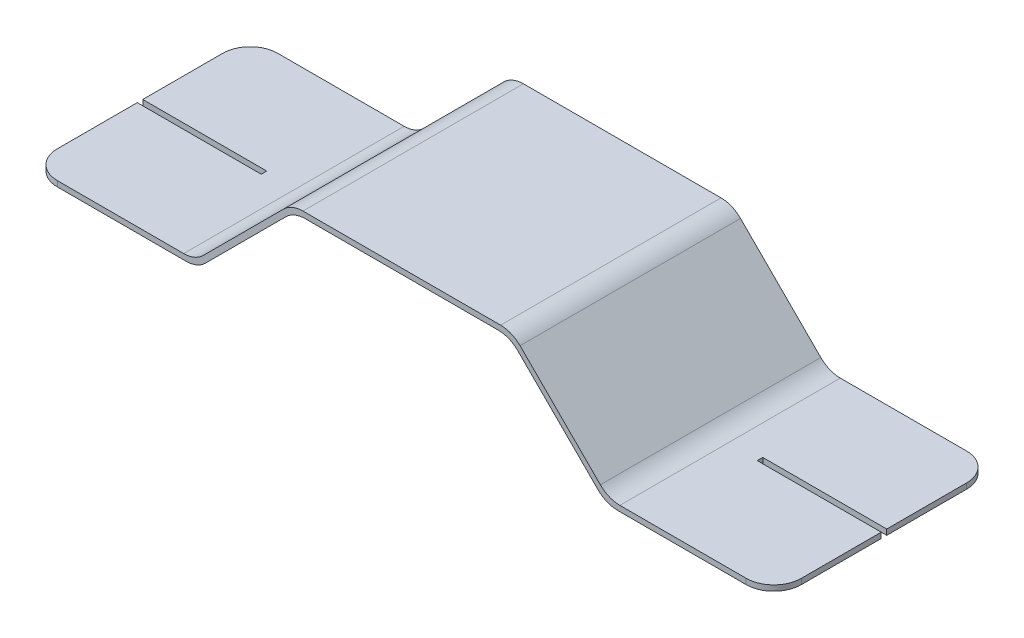
ISO-10303-21;
HEADER;
FILE_DESCRIPTION(('STEP AP214'),'2;1');
FILE_NAME('part.step','',(''),(''),'','','');
FILE_SCHEMA(('AUTOMOTIVE_DESIGN { 1 0 10303 214 1 1 1 1 }'));
ENDSEC;
DATA;
#1=APPLICATION_CONTEXT('core data for automotive mechanical design processes');
#2=APPLICATION_PROTOCOL_DEFINITION('international standard','automotive_design',2000,#1);
#3=PRODUCT_CONTEXT('',#1,'mechanical');
#4=PRODUCT('Part','Part','',(#3));
#5=PRODUCT_RELATED_PRODUCT_CATEGORY('part','',(#4));
#6=PRODUCT_DEFINITION_FORMATION('','',#4);
#7=PRODUCT_DEFINITION_CONTEXT('part definition',#1,'design');
#8=PRODUCT_DEFINITION('design','',#6,#7);
#9=PRODUCT_DEFINITION_SHAPE('','',#8);
#10=(LENGTH_UNIT() NAMED_UNIT(*) SI_UNIT(.MILLI.,.METRE.));
#11=(NAMED_UNIT(*) PLANE_ANGLE_UNIT() SI_UNIT($,.RADIAN.));
#12=(NAMED_UNIT(*) SI_UNIT($,.STERADIAN.) SOLID_ANGLE_UNIT());
#13=UNCERTAINTY_MEASURE_WITH_UNIT(LENGTH_MEASURE(1.E-05),#10,'distance_accuracy_value','');
#14=(GEOMETRIC_REPRESENTATION_CONTEXT(3) GLOBAL_UNCERTAINTY_ASSIGNED_CONTEXT((#13)) GLOBAL_UNIT_ASSIGNED_CONTEXT((#10,
#11,#12)) REPRESENTATION_CONTEXT('',''));
#15=CARTESIAN_POINT('',(0.,0.,0.));
#16=DIRECTION('',(0.,0.,1.));
#17=DIRECTION('',(1.,0.,0.));
#18=AXIS2_PLACEMENT_3D('',#15,#16,#17);
#19=CARTESIAN_POINT('',(11.4171572875254,-3.7,8.));
#20=DIRECTION('',(0.,1.,0.));
#21=DIRECTION('',(0.,0.,1.));
#22=AXIS2_PLACEMENT_3D('',#19,#20,#21);
#23=PLANE('',#22);
#24=DIRECTION('',(-1.,0.,0.));
#25=VECTOR('',#24,1.);
#26=CARTESIAN_POINT('',(11.4171572875254,-3.7,4.1));
#27=LINE('',#26,#25);
#28=CARTESIAN_POINT('',(17.5,-3.7,4.1));
#29=VERTEX_POINT('',#28);
#30=CARTESIAN_POINT('',(13.,-3.7,4.1));
#31=VERTEX_POINT('',#30);
#32=EDGE_CURVE('E292',#29,#31,#27,.T.);
#33=ORIENTED_EDGE('',*,*,#32,.F.);
#34=DIRECTION('',(0.,0.,-1.));
#35=VECTOR('',#34,1.);
#36=CARTESIAN_POINT('',(17.5,-3.7,8.));
#37=LINE('',#36,#35);
#38=CARTESIAN_POINT('',(17.5,-3.7,7.));
#39=VERTEX_POINT('',#38);
#40=EDGE_CURVE('E408',#39,#29,#37,.T.);
#41=ORIENTED_EDGE('',*,*,#40,.F.);
#42=CARTESIAN_POINT('',(16.5,-3.7,7.));
#43=DIRECTION('',(0.,1.,0.));
#44=DIRECTION('',(0.,0.,1.));
#45=AXIS2_PLACEMENT_3D('',#42,#43,#44);
#46=CIRCLE('',#45,1.);
#47=CARTESIAN_POINT('',(16.5,-3.7,8.));
#48=VERTEX_POINT('',#47);
#49=EDGE_CURVE('E555',#39,#48,#46,.F.);
#50=ORIENTED_EDGE('',*,*,#49,.T.);
#51=DIRECTION('',(1.,0.,0.));
#52=VECTOR('',#51,1.);
#53=CARTESIAN_POINT('',(11.4171572875254,-3.7,8.));
#54=LINE('',#53,#52);
#55=CARTESIAN_POINT('',(11.8313708498985,-3.7,8.));
#56=VERTEX_POINT('',#55);
#57=EDGE_CURVE('E350',#56,#48,#54,.T.);
#58=ORIENTED_EDGE('',*,*,#57,.F.);
#59=DIRECTION('',(0.,0.,-1.));
#60=VECTOR('',#59,1.);
#61=CARTESIAN_POINT('',(11.8313708498985,-3.7,8.));
#62=LINE('',#61,#60);
#63=CARTESIAN_POINT('',(11.8313708498985,-3.7,0.));
#64=VERTEX_POINT('',#63);
#65=EDGE_CURVE('E442',#56,#64,#62,.T.);
#66=ORIENTED_EDGE('',*,*,#65,.T.);
#67=DIRECTION('',(1.,0.,0.));
#68=VECTOR('',#67,1.);
#69=CARTESIAN_POINT('',(11.4171572875254,-3.7,0.));
#70=LINE('',#69,#68);
#71=CARTESIAN_POINT('',(16.5,-3.7,0.));
#72=VERTEX_POINT('',#71);
#73=EDGE_CURVE('E390',#64,#72,#70,.T.);
#74=ORIENTED_EDGE('',*,*,#73,.T.);
#75=CARTESIAN_POINT('',(16.5,-3.7,1.));
#76=DIRECTION('',(0.,1.,0.));
#77=DIRECTION('',(0.,0.,1.));
#78=AXIS2_PLACEMENT_3D('',#75,#76,#77);
#79=CIRCLE('',#78,1.);
#80=CARTESIAN_POINT('',(17.5,-3.7,1.));
#81=VERTEX_POINT('',#80);
#82=EDGE_CURVE('E558',#72,#81,#79,.F.);
#83=ORIENTED_EDGE('',*,*,#82,.T.);
#84=CARTESIAN_POINT('',(17.5,-3.7,3.9));
#85=VERTEX_POINT('',#84);
#86=EDGE_CURVE('E407',#85,#81,#37,.T.);
#87=ORIENTED_EDGE('',*,*,#86,.F.);
#88=DIRECTION('',(1.,0.,0.));
#89=VECTOR('',#88,1.);
#90=CARTESIAN_POINT('',(11.4171572875254,-3.7,3.9));
#91=LINE('',#90,#89);
#92=CARTESIAN_POINT('',(13.,-3.7,3.9));
#93=VERTEX_POINT('',#92);
#94=EDGE_CURVE('E283',#93,#85,#91,.T.);
#95=ORIENTED_EDGE('',*,*,#94,.F.);
#96=DIRECTION('',(0.,0.,-1.));
#97=VECTOR('',#96,1.);
#98=CARTESIAN_POINT('',(13.,-3.7,8.));
#99=LINE('',#98,#97);
#100=EDGE_CURVE('E260',#31,#93,#99,.T.);
#101=ORIENTED_EDGE('',*,*,#100,.F.);
#102=EDGE_LOOP('',(#33,#41,#50,#58,#66,#74,#83,#87,#95,#101));
#103=FACE_BOUND('',#102,.T.);
#104=ADVANCED_FACE('F42',(#103),#23,.F.);
#105=CARTESIAN_POINT('',(17.5,-3.5,8.));
#106=DIRECTION('',(-1.,0.,0.));
#107=DIRECTION('',(0.,0.,1.));
#108=AXIS2_PLACEMENT_3D('',#105,#106,#107);
#109=PLANE('',#108);
#110=DIRECTION('',(0.,1.,0.));
#111=VECTOR('',#110,1.);
#112=CARTESIAN_POINT('',(17.5,-13.5,4.1));
#113=LINE('',#112,#111);
#114=CARTESIAN_POINT('',(17.5,-3.5,4.1));
#115=VERTEX_POINT('',#114);
#116=EDGE_CURVE('E279',#29,#115,#113,.T.);
#117=ORIENTED_EDGE('',*,*,#116,.T.);
#118=DIRECTION('',(0.,0.,-1.));
#119=VECTOR('',#118,1.);
#120=CARTESIAN_POINT('',(17.5,-3.5,8.));
#121=LINE('',#120,#119);
#122=CARTESIAN_POINT('',(17.5,-3.5,7.));
#123=VERTEX_POINT('',#122);
#124=EDGE_CURVE('E404',#123,#115,#121,.T.);
#125=ORIENTED_EDGE('',*,*,#124,.F.);
#126=DIRECTION('',(0.,1.,0.));
#127=VECTOR('',#126,1.);
#128=CARTESIAN_POINT('',(17.5,-3.7,7.));
#129=LINE('',#128,#127);
#130=EDGE_CURVE('E536',#123,#39,#129,.F.);
#131=ORIENTED_EDGE('',*,*,#130,.T.);
#132=ORIENTED_EDGE('',*,*,#40,.T.);
#133=EDGE_LOOP('',(#117,#125,#131,#132));
#134=FACE_BOUND('',#133,.T.);
#135=ADVANCED_FACE('F718',(#134),#109,.F.);
#136=DIRECTION('',(0.,1.,0.));
#137=VECTOR('',#136,1.);
#138=CARTESIAN_POINT('',(17.5,-13.5,3.9));
#139=LINE('',#138,#137);
#140=CARTESIAN_POINT('',(17.5,-3.5,3.9));
#141=VERTEX_POINT('',#140);
#142=EDGE_CURVE('E58',#85,#141,#139,.T.);
#143=ORIENTED_EDGE('',*,*,#142,.F.);
#144=ORIENTED_EDGE('',*,*,#86,.T.);
#145=DIRECTION('',(0.,1.,0.));
#146=VECTOR('',#145,1.);
#147=CARTESIAN_POINT('',(17.5,-3.5,1.));
#148=LINE('',#147,#146);
#149=CARTESIAN_POINT('',(17.5,-3.5,1.));
#150=VERTEX_POINT('',#149);
#151=EDGE_CURVE('E539',#81,#150,#148,.T.);
#152=ORIENTED_EDGE('',*,*,#151,.T.);
#153=EDGE_CURVE('E365',#141,#150,#121,.T.);
#154=ORIENTED_EDGE('',*,*,#153,.F.);
#155=EDGE_LOOP('',(#143,#144,#152,#154));
#156=FACE_BOUND('',#155,.T.);
#157=ADVANCED_FACE('F624',(#156),#109,.F.);
#158=CARTESIAN_POINT('',(11.5,-3.5,8.));
#159=DIRECTION('',(0.,-1.,0.));
#160=DIRECTION('',(1.,0.,0.));
#161=AXIS2_PLACEMENT_3D('',#158,#159,#160);
#162=PLANE('',#161);
#163=DIRECTION('',(-1.,0.,0.));
#164=VECTOR('',#163,1.);
#165=CARTESIAN_POINT('',(17.5,-3.5,4.1));
#166=LINE('',#165,#164);
#167=CARTESIAN_POINT('',(13.,-3.5,4.1));
#168=VERTEX_POINT('',#167);
#169=EDGE_CURVE('E273',#115,#168,#166,.T.);
#170=ORIENTED_EDGE('',*,*,#169,.T.);
#171=DIRECTION('',(0.,0.,-1.));
#172=VECTOR('',#171,1.);
#173=CARTESIAN_POINT('',(13.,-3.5,3.9));
#174=LINE('',#173,#172);
#175=CARTESIAN_POINT('',(13.,-3.5,3.9));
#176=VERTEX_POINT('',#175);
#177=EDGE_CURVE('E257',#168,#176,#174,.T.);
#178=ORIENTED_EDGE('',*,*,#177,.T.);
#179=DIRECTION('',(1.,0.,0.));
#180=VECTOR('',#179,1.);
#181=CARTESIAN_POINT('',(17.5,-3.5,3.9));
#182=LINE('',#181,#180);
#183=EDGE_CURVE('E265',#176,#141,#182,.T.);
#184=ORIENTED_EDGE('',*,*,#183,.T.);
#185=ORIENTED_EDGE('',*,*,#153,.T.);
#186=CARTESIAN_POINT('',(16.5,-3.5,1.));
#187=DIRECTION('',(0.,-1.,0.));
#188=DIRECTION('',(1.,0.,0.));
#189=AXIS2_PLACEMENT_3D('',#186,#187,#188);
#190=CIRCLE('',#189,1.);
#191=CARTESIAN_POINT('',(16.5,-3.5,0.));
#192=VERTEX_POINT('',#191);
#193=EDGE_CURVE('E546',#150,#192,#190,.F.);
#194=ORIENTED_EDGE('',*,*,#193,.T.);
#195=DIRECTION('',(-1.,0.,0.));
#196=VECTOR('',#195,1.);
#197=CARTESIAN_POINT('',(11.5,-3.5,0.));
#198=LINE('',#197,#196);
#199=CARTESIAN_POINT('',(11.9142135623731,-3.5,0.));
#200=VERTEX_POINT('',#199);
#201=EDGE_CURVE('E394',#192,#200,#198,.T.);
#202=ORIENTED_EDGE('',*,*,#201,.T.);
#203=DIRECTION('',(0.,0.,-1.));
#204=VECTOR('',#203,1.);
#205=CARTESIAN_POINT('',(11.9142135623731,-3.5,8.));
#206=LINE('',#205,#204);
#207=CARTESIAN_POINT('',(11.9142135623731,-3.5,8.));
#208=VERTEX_POINT('',#207);
#209=EDGE_CURVE('E489',#200,#208,#206,.F.);
#210=ORIENTED_EDGE('',*,*,#209,.T.);
#211=DIRECTION('',(-1.,0.,0.));
#212=VECTOR('',#211,1.);
#213=CARTESIAN_POINT('',(11.5,-3.5,8.));
#214=LINE('',#213,#212);
#215=CARTESIAN_POINT('',(16.5,-3.5,8.));
#216=VERTEX_POINT('',#215);
#217=EDGE_CURVE('E354',#216,#208,#214,.T.);
#218=ORIENTED_EDGE('',*,*,#217,.F.);
#219=CARTESIAN_POINT('',(16.5,-3.5,7.));
#220=DIRECTION('',(0.,-1.,0.));
#221=DIRECTION('',(1.,0.,0.));
#222=AXIS2_PLACEMENT_3D('',#219,#220,#221);
#223=CIRCLE('',#222,1.);
#224=EDGE_CURVE('E543',#216,#123,#223,.F.);
#225=ORIENTED_EDGE('',*,*,#224,.T.);
#226=ORIENTED_EDGE('',*,*,#124,.T.);
#227=EDGE_LOOP('',(#170,#178,#184,#185,#194,#202,#210,#218,#225,#226));
#228=FACE_BOUND('',#227,.T.);
#229=ADVANCED_FACE('F271',(#228),#162,.F.);
#230=CARTESIAN_POINT('',(-9.5,-3.5,8.));
#231=DIRECTION('',(1.,0.,0.));
#232=DIRECTION('',(0.,0.,-1.));
#233=AXIS2_PLACEMENT_3D('',#230,#231,#232);
#234=PLANE('',#233);
#235=DIRECTION('',(0.,0.,-1.));
#236=VECTOR('',#235,1.);
#237=CARTESIAN_POINT('',(-9.5,-3.7,8.));
#238=LINE('',#237,#236);
#239=CARTESIAN_POINT('',(-9.5,-3.7,3.9));
#240=VERTEX_POINT('',#239);
#241=CARTESIAN_POINT('',(-9.5,-3.7,1.));
#242=VERTEX_POINT('',#241);
#243=EDGE_CURVE('E412',#240,#242,#238,.T.);
#244=ORIENTED_EDGE('',*,*,#243,.F.);
#245=DIRECTION('',(0.,1.,0.));
#246=VECTOR('',#245,1.);
#247=CARTESIAN_POINT('',(-9.5,-13.5,3.9));
#248=LINE('',#247,#246);
#249=CARTESIAN_POINT('',(-9.5,-3.5,3.9));
#250=VERTEX_POINT('',#249);
#251=EDGE_CURVE('E306',#240,#250,#248,.T.);
#252=ORIENTED_EDGE('',*,*,#251,.T.);
#253=DIRECTION('',(0.,0.,-1.));
#254=VECTOR('',#253,1.);
#255=CARTESIAN_POINT('',(-9.5,-3.5,8.));
#256=LINE('',#255,#254);
#257=CARTESIAN_POINT('',(-9.5,-3.5,1.));
#258=VERTEX_POINT('',#257);
#259=EDGE_CURVE('E417',#250,#258,#256,.T.);
#260=ORIENTED_EDGE('',*,*,#259,.T.);
#261=DIRECTION('',(0.,-1.,0.));
#262=VECTOR('',#261,1.);
#263=CARTESIAN_POINT('',(-9.5,-3.5,1.));
#264=LINE('',#263,#262);
#265=EDGE_CURVE('E573',#258,#242,#264,.T.);
#266=ORIENTED_EDGE('',*,*,#265,.T.);
#267=EDGE_LOOP('',(#244,#252,#260,#266));
#268=FACE_BOUND('',#267,.T.);
#269=ADVANCED_FACE('F607',(#268),#234,.F.);
#270=CARTESIAN_POINT('',(0.,0.,8.));
#271=DIRECTION('',(0.707106781186548,-0.707106781186547,0.));
#272=DIRECTION('',(0.707106781186547,0.707106781186548,0.));
#273=AXIS2_PLACEMENT_3D('',#270,#271,#272);
#274=PLANE('',#273);
#275=CARTESIAN_POINT('',(-1.76776695296637,-1.76776695296637,2.25));
#276=DIRECTION('',(-0.707106781186548,0.707106781186547,0.));
#277=DIRECTION('',(-0.707106781186547,-0.707106781186548,0.));
#278=AXIS2_PLACEMENT_3D('',#275,#276,#277);
#279=CIRCLE('',#278,1.190625);
#280=CARTESIAN_POINT('',(-2.6096659643166,-2.6096659643166,2.25));
#281=VERTEX_POINT('',#280);
#282=EDGE_CURVE('E318',#281,#281,#279,.T.);
#283=ORIENTED_EDGE('',*,*,#282,.F.);
#284=EDGE_LOOP('',(#283));
#285=FACE_BOUND('',#284,.T.);
#286=CARTESIAN_POINT('',(-1.76776695296637,-1.76776695296637,5.75));
#287=DIRECTION('',(-0.707106781186548,0.707106781186547,0.));
#288=DIRECTION('',(-0.707106781186547,-0.707106781186548,0.));
#289=AXIS2_PLACEMENT_3D('',#286,#287,#288);
#290=CIRCLE('',#289,1.190625);
#291=CARTESIAN_POINT('',(-2.6096659643166,-2.6096659643166,5.75));
#292=VERTEX_POINT('',#291);
#293=EDGE_CURVE('E310',#292,#292,#290,.T.);
#294=ORIENTED_EDGE('',*,*,#293,.F.);
#295=EDGE_LOOP('',(#294));
#296=FACE_BOUND('',#295,.T.);
#297=DIRECTION('',(-0.707106781186547,-0.707106781186548,0.));
#298=VECTOR('',#297,1.);
#299=CARTESIAN_POINT('',(0.,0.,8.));
#300=LINE('',#299,#298);
#301=CARTESIAN_POINT('',(-0.292893218813452,-0.292893218813452,8.));
#302=VERTEX_POINT('',#301);
#303=CARTESIAN_POINT('',(-3.20710678118655,-3.20710678118655,8.));
#304=VERTEX_POINT('',#303);
#305=EDGE_CURVE('E326',#302,#304,#300,.T.);
#306=ORIENTED_EDGE('',*,*,#305,.F.);
#307=DIRECTION('',(0.,0.,-1.));
#308=VECTOR('',#307,1.);
#309=CARTESIAN_POINT('',(-0.292893218813452,-0.292893218813452,8.));
#310=LINE('',#309,#308);
#311=CARTESIAN_POINT('',(-0.292893218813452,-0.292893218813452,0.));
#312=VERTEX_POINT('',#311);
#313=EDGE_CURVE('E503',#302,#312,#310,.T.);
#314=ORIENTED_EDGE('',*,*,#313,.T.);
#315=DIRECTION('',(-0.707106781186547,-0.707106781186548,0.));
#316=VECTOR('',#315,1.);
#317=CARTESIAN_POINT('',(0.,0.,0.));
#318=LINE('',#317,#316);
#319=CARTESIAN_POINT('',(-3.20710678118655,-3.20710678118655,0.));
#320=VERTEX_POINT('',#319);
#321=EDGE_CURVE('E366',#312,#320,#318,.T.);
#322=ORIENTED_EDGE('',*,*,#321,.T.);
#323=DIRECTION('',(0.,0.,-1.));
#324=VECTOR('',#323,1.);
#325=CARTESIAN_POINT('',(-3.20710678118655,-3.20710678118655,8.));
#326=LINE('',#325,#324);
#327=EDGE_CURVE('E500',#320,#304,#326,.F.);
#328=ORIENTED_EDGE('',*,*,#327,.T.);
#329=EDGE_LOOP('',(#306,#314,#322,#328));
#330=FACE_BOUND('',#329,.T.);
#331=ADVANCED_FACE('F663',(#285,#296,#330),#274,.F.);
#332=CARTESIAN_POINT('',(-3.5,-3.5,8.));
#333=DIRECTION('',(0.,-1.,0.));
#334=DIRECTION('',(1.,0.,0.));
#335=AXIS2_PLACEMENT_3D('',#332,#333,#334);
#336=PLANE('',#335);
#337=ORIENTED_EDGE('',*,*,#259,.F.);
#338=DIRECTION('',(-1.,0.,0.));
#339=VECTOR('',#338,1.);
#340=CARTESIAN_POINT('',(-9.5,-3.5,3.9));
#341=LINE('',#340,#339);
#342=CARTESIAN_POINT('',(-5.,-3.5,3.9));
#343=VERTEX_POINT('',#342);
#344=EDGE_CURVE('E302',#343,#250,#341,.T.);
#345=ORIENTED_EDGE('',*,*,#344,.F.);
#346=DIRECTION('',(0.,0.,-1.));
#347=VECTOR('',#346,1.);
#348=CARTESIAN_POINT('',(-5.,-3.5,3.9));
#349=LINE('',#348,#347);
#350=CARTESIAN_POINT('',(-5.,-3.5,4.1));
#351=VERTEX_POINT('',#350);
#352=EDGE_CURVE('E298',#351,#343,#349,.T.);
#353=ORIENTED_EDGE('',*,*,#352,.F.);
#354=DIRECTION('',(1.,0.,0.));
#355=VECTOR('',#354,1.);
#356=CARTESIAN_POINT('',(-9.5,-3.5,4.1));
#357=LINE('',#356,#355);
#358=CARTESIAN_POINT('',(-9.5,-3.5,4.1));
#359=VERTEX_POINT('',#358);
#360=EDGE_CURVE('E295',#359,#351,#357,.T.);
#361=ORIENTED_EDGE('',*,*,#360,.F.);
#362=CARTESIAN_POINT('',(-9.5,-3.5,7.));
#363=VERTEX_POINT('',#362);
#364=EDGE_CURVE('E418',#363,#359,#256,.T.);
#365=ORIENTED_EDGE('',*,*,#364,.F.);
#366=CARTESIAN_POINT('',(-8.5,-3.5,7.));
#367=DIRECTION('',(0.,-1.,0.));
#368=DIRECTION('',(1.,0.,0.));
#369=AXIS2_PLACEMENT_3D('',#366,#367,#368);
#370=CIRCLE('',#369,1.);
#371=CARTESIAN_POINT('',(-8.5,-3.5,8.));
#372=VERTEX_POINT('',#371);
#373=EDGE_CURVE('E583',#363,#372,#370,.F.);
#374=ORIENTED_EDGE('',*,*,#373,.T.);
#375=DIRECTION('',(-1.,0.,0.));
#376=VECTOR('',#375,1.);
#377=CARTESIAN_POINT('',(-3.5,-3.5,8.));
#378=LINE('',#377,#376);
#379=CARTESIAN_POINT('',(-3.91421356237309,-3.5,8.));
#380=VERTEX_POINT('',#379);
#381=EDGE_CURVE('E330',#380,#372,#378,.T.);
#382=ORIENTED_EDGE('',*,*,#381,.F.);
#383=DIRECTION('',(0.,0.,-1.));
#384=VECTOR('',#383,1.);
#385=CARTESIAN_POINT('',(-3.91421356237309,-3.5,0.));
#386=LINE('',#385,#384);
#387=CARTESIAN_POINT('',(-3.91421356237309,-3.5,0.));
#388=VERTEX_POINT('',#387);
#389=EDGE_CURVE('E507',#380,#388,#386,.T.);
#390=ORIENTED_EDGE('',*,*,#389,.T.);
#391=DIRECTION('',(-1.,0.,0.));
#392=VECTOR('',#391,1.);
#393=CARTESIAN_POINT('',(-3.5,-3.5,0.));
#394=LINE('',#393,#392);
#395=CARTESIAN_POINT('',(-8.5,-3.5,0.));
#396=VERTEX_POINT('',#395);
#397=EDGE_CURVE('E370',#388,#396,#394,.T.);
#398=ORIENTED_EDGE('',*,*,#397,.T.);
#399=CARTESIAN_POINT('',(-8.5,-3.5,1.));
#400=DIRECTION('',(0.,-1.,0.));
#401=DIRECTION('',(1.,0.,0.));
#402=AXIS2_PLACEMENT_3D('',#399,#400,#401);
#403=CIRCLE('',#402,1.);
#404=EDGE_CURVE('E586',#396,#258,#403,.F.);
#405=ORIENTED_EDGE('',*,*,#404,.T.);
#406=EDGE_LOOP('',(#337,#345,#353,#361,#365,#374,#382,#390,#398,#405));
#407=FACE_BOUND('',#406,.T.);
#408=ADVANCED_FACE('F609',(#407),#336,.F.);
#409=ORIENTED_EDGE('',*,*,#364,.T.);
#410=DIRECTION('',(0.,1.,0.));
#411=VECTOR('',#410,1.);
#412=CARTESIAN_POINT('',(-9.5,-13.5,4.1));
#413=LINE('',#412,#411);
#414=CARTESIAN_POINT('',(-9.5,-3.7,4.1));
#415=VERTEX_POINT('',#414);
#416=EDGE_CURVE('E305',#415,#359,#413,.T.);
#417=ORIENTED_EDGE('',*,*,#416,.F.);
#418=CARTESIAN_POINT('',(-9.5,-3.7,7.));
#419=VERTEX_POINT('',#418);
#420=EDGE_CURVE('E413',#419,#415,#238,.T.);
#421=ORIENTED_EDGE('',*,*,#420,.F.);
#422=DIRECTION('',(0.,-1.,0.));
#423=VECTOR('',#422,1.);
#424=CARTESIAN_POINT('',(-9.5,-3.5,7.));
#425=LINE('',#424,#423);
#426=EDGE_CURVE('E570',#419,#363,#425,.F.);
#427=ORIENTED_EDGE('',*,*,#426,.T.);
#428=EDGE_LOOP('',(#409,#417,#421,#427));
#429=FACE_BOUND('',#428,.T.);
#430=ADVANCED_FACE('F747',(#429),#234,.F.);
#431=CARTESIAN_POINT('',(-3.41715728752538,-3.7,8.));
#432=DIRECTION('',(0.,1.,0.));
#433=DIRECTION('',(-1.,0.,0.));
#434=AXIS2_PLACEMENT_3D('',#431,#432,#433);
#435=PLANE('',#434);
#436=DIRECTION('',(0.,0.,-1.));
#437=VECTOR('',#436,1.);
#438=CARTESIAN_POINT('',(-5.,-3.7,8.));
#439=LINE('',#438,#437);
#440=CARTESIAN_POINT('',(-5.,-3.7,4.1));
#441=VERTEX_POINT('',#440);
#442=CARTESIAN_POINT('',(-5.,-3.7,3.9));
#443=VERTEX_POINT('',#442);
#444=EDGE_CURVE('E51',#441,#443,#439,.T.);
#445=ORIENTED_EDGE('',*,*,#444,.T.);
#446=DIRECTION('',(-1.,0.,0.));
#447=VECTOR('',#446,1.);
#448=CARTESIAN_POINT('',(-3.41715728752538,-3.7,3.9));
#449=LINE('',#448,#447);
#450=EDGE_CURVE('E11',#443,#240,#449,.T.);
#451=ORIENTED_EDGE('',*,*,#450,.T.);
#452=ORIENTED_EDGE('',*,*,#243,.T.);
#453=CARTESIAN_POINT('',(-8.5,-3.7,1.));
#454=DIRECTION('',(0.,1.,0.));
#455=DIRECTION('',(-1.,0.,0.));
#456=AXIS2_PLACEMENT_3D('',#453,#454,#455);
#457=CIRCLE('',#456,1.);
#458=CARTESIAN_POINT('',(-8.5,-3.7,0.));
#459=VERTEX_POINT('',#458);
#460=EDGE_CURVE('E580',#242,#459,#457,.F.);
#461=ORIENTED_EDGE('',*,*,#460,.T.);
#462=DIRECTION('',(1.,0.,0.));
#463=VECTOR('',#462,1.);
#464=CARTESIAN_POINT('',(-3.41715728752538,-3.7,0.));
#465=LINE('',#464,#463);
#466=CARTESIAN_POINT('',(-3.83137084989848,-3.7,0.));
#467=VERTEX_POINT('',#466);
#468=EDGE_CURVE('E375',#459,#467,#465,.T.);
#469=ORIENTED_EDGE('',*,*,#468,.T.);
#470=DIRECTION('',(0.,0.,-1.));
#471=VECTOR('',#470,1.);
#472=CARTESIAN_POINT('',(-3.83137084989848,-3.7,8.));
#473=LINE('',#472,#471);
#474=CARTESIAN_POINT('',(-3.83137084989848,-3.7,8.));
#475=VERTEX_POINT('',#474);
#476=EDGE_CURVE('E478',#467,#475,#473,.F.);
#477=ORIENTED_EDGE('',*,*,#476,.T.);
#478=DIRECTION('',(1.,0.,0.));
#479=VECTOR('',#478,1.);
#480=CARTESIAN_POINT('',(-3.41715728752538,-3.7,8.));
#481=LINE('',#480,#479);
#482=CARTESIAN_POINT('',(-8.5,-3.7,8.));
#483=VERTEX_POINT('',#482);
#484=EDGE_CURVE('E335',#483,#475,#481,.T.);
#485=ORIENTED_EDGE('',*,*,#484,.F.);
#486=CARTESIAN_POINT('',(-8.5,-3.7,7.));
#487=DIRECTION('',(0.,1.,0.));
#488=DIRECTION('',(-1.,0.,0.));
#489=AXIS2_PLACEMENT_3D('',#486,#487,#488);
#490=CIRCLE('',#489,1.);
#491=EDGE_CURVE('E577',#483,#419,#490,.F.);
#492=ORIENTED_EDGE('',*,*,#491,.T.);
#493=ORIENTED_EDGE('',*,*,#420,.T.);
#494=DIRECTION('',(1.,0.,0.));
#495=VECTOR('',#494,1.);
#496=CARTESIAN_POINT('',(-3.41715728752538,-3.7,4.1));
#497=LINE('',#496,#495);
#498=EDGE_CURVE('E590',#415,#441,#497,.T.);
#499=ORIENTED_EDGE('',*,*,#498,.T.);
#500=EDGE_LOOP('',(#445,#451,#452,#461,#469,#477,#485,#492,#493,#499));
#501=FACE_BOUND('',#500,.T.);
#502=ADVANCED_FACE('F596',(#501),#435,.F.);
#503=CARTESIAN_POINT('',(0.082842712474619,-0.2,8.));
#504=DIRECTION('',(-0.707106781186548,0.707106781186547,0.));
#505=DIRECTION('',(-0.707106781186547,-0.707106781186548,0.));
#506=AXIS2_PLACEMENT_3D('',#503,#504,#505);
#507=PLANE('',#506);
#508=CARTESIAN_POINT('',(-1.62634559672906,-1.90918830920368,2.25));
#509=DIRECTION('',(-0.707106781186548,0.707106781186547,0.));
#510=DIRECTION('',(-0.707106781186547,-0.707106781186548,0.));
#511=AXIS2_PLACEMENT_3D('',#508,#509,#510);
#512=CIRCLE('',#511,1.190625);
#513=CARTESIAN_POINT('',(-2.46824460807929,-2.75108732055391,2.25));
#514=VERTEX_POINT('',#513);
#515=EDGE_CURVE('E371',#514,#514,#512,.T.);
#516=ORIENTED_EDGE('',*,*,#515,.T.);
#517=EDGE_LOOP('',(#516));
#518=FACE_BOUND('',#517,.T.);
#519=CARTESIAN_POINT('',(-1.62634559672906,-1.90918830920368,5.75));
#520=DIRECTION('',(-0.707106781186548,0.707106781186547,0.));
#521=DIRECTION('',(-0.707106781186547,-0.707106781186548,0.));
#522=AXIS2_PLACEMENT_3D('',#519,#520,#521);
#523=CIRCLE('',#522,1.190625);
#524=CARTESIAN_POINT('',(-2.46824460807929,-2.75108732055391,5.75));
#525=VERTEX_POINT('',#524);
#526=EDGE_CURVE('E322',#525,#525,#523,.T.);
#527=ORIENTED_EDGE('',*,*,#526,.T.);
#528=EDGE_LOOP('',(#527));
#529=FACE_BOUND('',#528,.T.);
#530=DIRECTION('',(0.707106781186547,0.707106781186548,0.));
#531=VECTOR('',#530,1.);
#532=CARTESIAN_POINT('',(0.082842712474619,-0.2,8.));
#533=LINE('',#532,#531);
#534=CARTESIAN_POINT('',(-3.12426406871193,-3.40710678118655,8.));
#535=VERTEX_POINT('',#534);
#536=CARTESIAN_POINT('',(-0.210050506338834,-0.492893218813453,8.));
#537=VERTEX_POINT('',#536);
#538=EDGE_CURVE('E338',#535,#537,#533,.T.);
#539=ORIENTED_EDGE('',*,*,#538,.F.);
#540=DIRECTION('',(0.,0.,-1.));
#541=VECTOR('',#540,1.);
#542=CARTESIAN_POINT('',(-3.12426406871193,-3.40710678118655,8.));
#543=LINE('',#542,#541);
#544=CARTESIAN_POINT('',(-3.12426406871193,-3.40710678118655,0.));
#545=VERTEX_POINT('',#544);
#546=EDGE_CURVE('E474',#535,#545,#543,.T.);
#547=ORIENTED_EDGE('',*,*,#546,.T.);
#548=DIRECTION('',(0.707106781186547,0.707106781186548,0.));
#549=VECTOR('',#548,1.);
#550=CARTESIAN_POINT('',(0.082842712474619,-0.2,0.));
#551=LINE('',#550,#549);
#552=CARTESIAN_POINT('',(-0.210050506338834,-0.492893218813453,0.));
#553=VERTEX_POINT('',#552);
#554=EDGE_CURVE('E378',#545,#553,#551,.T.);
#555=ORIENTED_EDGE('',*,*,#554,.T.);
#556=DIRECTION('',(0.,0.,-1.));
#557=VECTOR('',#556,1.);
#558=CARTESIAN_POINT('',(-0.210050506338834,-0.492893218813453,8.));
#559=LINE('',#558,#557);
#560=EDGE_CURVE('E471',#553,#537,#559,.F.);
#561=ORIENTED_EDGE('',*,*,#560,.T.);
#562=EDGE_LOOP('',(#539,#547,#555,#561));
#563=FACE_BOUND('',#562,.T.);
#564=ADVANCED_FACE('F688',(#518,#529,#563),#507,.F.);
#565=CARTESIAN_POINT('',(0.082842712474619,-0.2,8.));
#566=DIRECTION('',(0.,1.,0.));
#567=DIRECTION('',(0.,0.,1.));
#568=AXIS2_PLACEMENT_3D('',#565,#566,#567);
#569=PLANE('',#568);
#570=DIRECTION('',(1.,0.,0.));
#571=VECTOR('',#570,1.);
#572=CARTESIAN_POINT('',(0.082842712474619,-0.2,0.));
#573=LINE('',#572,#571);
#574=CARTESIAN_POINT('',(0.497056274847714,-0.2,0.));
#575=VERTEX_POINT('',#574);
#576=CARTESIAN_POINT('',(7.50294372515229,-0.2,0.));
#577=VERTEX_POINT('',#576);
#578=EDGE_CURVE('E382',#575,#577,#573,.T.);
#579=ORIENTED_EDGE('',*,*,#578,.T.);
#580=DIRECTION('',(0.,0.,-1.));
#581=VECTOR('',#580,1.);
#582=CARTESIAN_POINT('',(7.50294372515229,-0.2,8.));
#583=LINE('',#582,#581);
#584=CARTESIAN_POINT('',(7.50294372515229,-0.2,8.));
#585=VERTEX_POINT('',#584);
#586=EDGE_CURVE('E439',#577,#585,#583,.F.);
#587=ORIENTED_EDGE('',*,*,#586,.T.);
#588=DIRECTION('',(1.,0.,0.));
#589=VECTOR('',#588,1.);
#590=CARTESIAN_POINT('',(0.082842712474619,-0.2,8.));
#591=LINE('',#590,#589);
#592=CARTESIAN_POINT('',(0.497056274847714,-0.2,8.));
#593=VERTEX_POINT('',#592);
#594=EDGE_CURVE('E342',#593,#585,#591,.T.);
#595=ORIENTED_EDGE('',*,*,#594,.F.);
#596=DIRECTION('',(0.,0.,-1.));
#597=VECTOR('',#596,1.);
#598=CARTESIAN_POINT('',(0.497056274847714,-0.2,0.));
#599=LINE('',#598,#597);
#600=EDGE_CURVE('E435',#593,#575,#599,.T.);
#601=ORIENTED_EDGE('',*,*,#600,.T.);
#602=EDGE_LOOP('',(#579,#587,#595,#601));
#603=FACE_BOUND('',#602,.T.);
#604=ADVANCED_FACE('F697',(#603),#569,.F.);
#605=CARTESIAN_POINT('',(7.91715728752538,-0.2,8.));
#606=DIRECTION('',(0.707106781186548,0.707106781186547,0.));
#607=DIRECTION('',(-0.707106781186547,0.707106781186548,0.));
#608=AXIS2_PLACEMENT_3D('',#605,#606,#607);
#609=PLANE('',#608);
#610=DIRECTION('',(0.707106781186547,-0.707106781186548,0.));
#611=VECTOR('',#610,1.);
#612=CARTESIAN_POINT('',(7.91715728752538,-0.2,8.));
#613=LINE('',#612,#611);
#614=CARTESIAN_POINT('',(8.21005050633883,-0.492893218813452,8.));
#615=VERTEX_POINT('',#614);
#616=CARTESIAN_POINT('',(11.1242640687119,-3.40710678118655,8.));
#617=VERTEX_POINT('',#616);
#618=EDGE_CURVE('E346',#615,#617,#613,.T.);
#619=ORIENTED_EDGE('',*,*,#618,.F.);
#620=DIRECTION('',(0.,0.,-1.));
#621=VECTOR('',#620,1.);
#622=CARTESIAN_POINT('',(8.21005050633883,-0.492893218813452,0.));
#623=LINE('',#622,#621);
#624=CARTESIAN_POINT('',(8.21005050633883,-0.492893218813452,0.));
#625=VERTEX_POINT('',#624);
#626=EDGE_CURVE('E431',#615,#625,#623,.T.);
#627=ORIENTED_EDGE('',*,*,#626,.T.);
#628=DIRECTION('',(0.707106781186547,-0.707106781186548,0.));
#629=VECTOR('',#628,1.);
#630=CARTESIAN_POINT('',(7.91715728752538,-0.2,0.));
#631=LINE('',#630,#629);
#632=CARTESIAN_POINT('',(11.1242640687119,-3.40710678118655,0.));
#633=VERTEX_POINT('',#632);
#634=EDGE_CURVE('E386',#625,#633,#631,.T.);
#635=ORIENTED_EDGE('',*,*,#634,.T.);
#636=DIRECTION('',(0.,0.,-1.));
#637=VECTOR('',#636,1.);
#638=CARTESIAN_POINT('',(11.1242640687119,-3.40710678118655,8.));
#639=LINE('',#638,#637);
#640=EDGE_CURVE('E422',#633,#617,#639,.F.);
#641=ORIENTED_EDGE('',*,*,#640,.T.);
#642=EDGE_LOOP('',(#619,#627,#635,#641));
#643=FACE_BOUND('',#642,.T.);
#644=ADVANCED_FACE('F706',(#643),#609,.F.);
#645=CARTESIAN_POINT('',(8.,0.,8.));
#646=DIRECTION('',(-0.707106781186547,-0.707106781186548,0.));
#647=DIRECTION('',(0.707106781186548,-0.707106781186547,0.));
#648=AXIS2_PLACEMENT_3D('',#645,#646,#647);
#649=PLANE('',#648);
#650=DIRECTION('',(-0.707106781186548,0.707106781186547,0.));
#651=VECTOR('',#650,1.);
#652=CARTESIAN_POINT('',(8.,0.,8.));
#653=LINE('',#652,#651);
#654=CARTESIAN_POINT('',(11.2071067811865,-3.20710678118655,8.));
#655=VERTEX_POINT('',#654);
#656=CARTESIAN_POINT('',(8.29289321881345,-0.292893218813452,8.));
#657=VERTEX_POINT('',#656);
#658=EDGE_CURVE('E357',#655,#657,#653,.T.);
#659=ORIENTED_EDGE('',*,*,#658,.F.);
#660=DIRECTION('',(0.,0.,-1.));
#661=VECTOR('',#660,1.);
#662=CARTESIAN_POINT('',(11.2071067811865,-3.20710678118655,0.));
#663=LINE('',#662,#661);
#664=CARTESIAN_POINT('',(11.2071067811865,-3.20710678118655,0.));
#665=VERTEX_POINT('',#664);
#666=EDGE_CURVE('E485',#655,#665,#663,.T.);
#667=ORIENTED_EDGE('',*,*,#666,.T.);
#668=DIRECTION('',(-0.707106781186548,0.707106781186547,0.));
#669=VECTOR('',#668,1.);
#670=CARTESIAN_POINT('',(8.,0.,0.));
#671=LINE('',#670,#669);
#672=CARTESIAN_POINT('',(8.29289321881345,-0.292893218813452,0.));
#673=VERTEX_POINT('',#672);
#674=EDGE_CURVE('E397',#665,#673,#671,.T.);
#675=ORIENTED_EDGE('',*,*,#674,.T.);
#676=DIRECTION('',(0.,0.,-1.));
#677=VECTOR('',#676,1.);
#678=CARTESIAN_POINT('',(8.29289321881345,-0.292893218813452,8.));
#679=LINE('',#678,#677);
#680=EDGE_CURVE('E482',#673,#657,#679,.F.);
#681=ORIENTED_EDGE('',*,*,#680,.T.);
#682=EDGE_LOOP('',(#659,#667,#675,#681));
#683=FACE_BOUND('',#682,.T.);
#684=ADVANCED_FACE('F646',(#683),#649,.F.);
#685=CARTESIAN_POINT('',(0.,0.,8.));
#686=DIRECTION('',(0.,-1.,0.));
#687=DIRECTION('',(0.,0.,-1.));
#688=AXIS2_PLACEMENT_3D('',#685,#686,#687);
#689=PLANE('',#688);
#690=DIRECTION('',(-1.,0.,0.));
#691=VECTOR('',#690,1.);
#692=CARTESIAN_POINT('',(0.,0.,8.));
#693=LINE('',#692,#691);
#694=CARTESIAN_POINT('',(7.5857864376269,0.,8.));
#695=VERTEX_POINT('',#694);
#696=CARTESIAN_POINT('',(0.414213562373095,0.,8.));
#697=VERTEX_POINT('',#696);
#698=EDGE_CURVE('E361',#695,#697,#693,.T.);
#699=ORIENTED_EDGE('',*,*,#698,.F.);
#700=DIRECTION('',(0.,0.,-1.));
#701=VECTOR('',#700,1.);
#702=CARTESIAN_POINT('',(7.5857864376269,0.,8.));
#703=LINE('',#702,#701);
#704=CARTESIAN_POINT('',(7.5857864376269,0.,0.));
#705=VERTEX_POINT('',#704);
#706=EDGE_CURVE('E496',#695,#705,#703,.T.);
#707=ORIENTED_EDGE('',*,*,#706,.T.);
#708=DIRECTION('',(-1.,0.,0.));
#709=VECTOR('',#708,1.);
#710=CARTESIAN_POINT('',(0.,0.,0.));
#711=LINE('',#710,#709);
#712=CARTESIAN_POINT('',(0.414213562373095,0.,0.));
#713=VERTEX_POINT('',#712);
#714=EDGE_CURVE('E331',#705,#713,#711,.T.);
#715=ORIENTED_EDGE('',*,*,#714,.T.);
#716=DIRECTION('',(0.,0.,-1.));
#717=VECTOR('',#716,1.);
#718=CARTESIAN_POINT('',(0.414213562373095,0.,8.));
#719=LINE('',#718,#717);
#720=EDGE_CURVE('E493',#713,#697,#719,.F.);
#721=ORIENTED_EDGE('',*,*,#720,.T.);
#722=EDGE_LOOP('',(#699,#707,#715,#721));
#723=FACE_BOUND('',#722,.T.);
#724=ADVANCED_FACE('F654',(#723),#689,.F.);
#725=CARTESIAN_POINT('',(0.,0.,8.));
#726=DIRECTION('',(0.,0.,1.));
#727=DIRECTION('',(1.,0.,0.));
#728=AXIS2_PLACEMENT_3D('',#725,#726,#727);
#729=PLANE('',#728);
#730=ORIENTED_EDGE('',*,*,#57,.T.);
#731=DIRECTION('',(0.,1.,0.));
#732=VECTOR('',#731,1.);
#733=CARTESIAN_POINT('',(16.5,-3.5,8.));
#734=LINE('',#733,#732);
#735=EDGE_CURVE('E566',#48,#216,#734,.T.);
#736=ORIENTED_EDGE('',*,*,#735,.T.);
#737=ORIENTED_EDGE('',*,*,#217,.T.);
#738=CARTESIAN_POINT('',(11.9142135623731,-2.5,8.));
#739=DIRECTION('',(0.,0.,1.));
#740=DIRECTION('',(1.,0.,0.));
#741=AXIS2_PLACEMENT_3D('',#738,#739,#740);
#742=CIRCLE('',#741,1.);
#743=EDGE_CURVE('E527',#208,#655,#742,.F.);
#744=ORIENTED_EDGE('',*,*,#743,.T.);
#745=ORIENTED_EDGE('',*,*,#658,.T.);
#746=CARTESIAN_POINT('',(7.5857864376269,-1.,8.));
#747=DIRECTION('',(0.,0.,1.));
#748=DIRECTION('',(1.,0.,0.));
#749=AXIS2_PLACEMENT_3D('',#746,#747,#748);
#750=CIRCLE('',#749,1.);
#751=EDGE_CURVE('E462',#657,#695,#750,.T.);
#752=ORIENTED_EDGE('',*,*,#751,.T.);
#753=ORIENTED_EDGE('',*,*,#698,.T.);
#754=CARTESIAN_POINT('',(0.414213562373095,-1.,8.));
#755=DIRECTION('',(0.,0.,1.));
#756=DIRECTION('',(1.,0.,0.));
#757=AXIS2_PLACEMENT_3D('',#754,#755,#756);
#758=CIRCLE('',#757,1.);
#759=EDGE_CURVE('E459',#697,#302,#758,.T.);
#760=ORIENTED_EDGE('',*,*,#759,.T.);
#761=ORIENTED_EDGE('',*,*,#305,.T.);
#762=CARTESIAN_POINT('',(-3.91421356237309,-2.5,8.));
#763=DIRECTION('',(0.,0.,1.));
#764=DIRECTION('',(1.,0.,0.));
#765=AXIS2_PLACEMENT_3D('',#762,#763,#764);
#766=CIRCLE('',#765,1.);
#767=EDGE_CURVE('E533',#304,#380,#766,.F.);
#768=ORIENTED_EDGE('',*,*,#767,.T.);
#769=ORIENTED_EDGE('',*,*,#381,.T.);
#770=DIRECTION('',(0.,-1.,0.));
#771=VECTOR('',#770,1.);
#772=CARTESIAN_POINT('',(-8.5,-3.7,8.));
#773=LINE('',#772,#771);
#774=EDGE_CURVE('E562',#372,#483,#773,.T.);
#775=ORIENTED_EDGE('',*,*,#774,.T.);
#776=ORIENTED_EDGE('',*,*,#484,.T.);
#777=CARTESIAN_POINT('',(-3.83137084989848,-2.7,8.));
#778=DIRECTION('',(0.,0.,1.));
#779=DIRECTION('',(1.,0.,0.));
#780=AXIS2_PLACEMENT_3D('',#777,#778,#779);
#781=CIRCLE('',#780,1.);
#782=EDGE_CURVE('E465',#475,#535,#781,.T.);
#783=ORIENTED_EDGE('',*,*,#782,.T.);
#784=ORIENTED_EDGE('',*,*,#538,.T.);
#785=CARTESIAN_POINT('',(0.497056274847714,-1.2,8.));
#786=DIRECTION('',(0.,0.,1.));
#787=DIRECTION('',(1.,0.,0.));
#788=AXIS2_PLACEMENT_3D('',#785,#786,#787);
#789=CIRCLE('',#788,1.);
#790=EDGE_CURVE('E520',#537,#593,#789,.F.);
#791=ORIENTED_EDGE('',*,*,#790,.T.);
#792=ORIENTED_EDGE('',*,*,#594,.T.);
#793=CARTESIAN_POINT('',(7.50294372515229,-1.2,8.));
#794=DIRECTION('',(0.,0.,1.));
#795=DIRECTION('',(1.,0.,0.));
#796=AXIS2_PLACEMENT_3D('',#793,#794,#795);
#797=CIRCLE('',#796,1.);
#798=EDGE_CURVE('E514',#585,#615,#797,.F.);
#799=ORIENTED_EDGE('',*,*,#798,.T.);
#800=ORIENTED_EDGE('',*,*,#618,.T.);
#801=CARTESIAN_POINT('',(11.8313708498985,-2.7,8.));
#802=DIRECTION('',(0.,0.,1.));
#803=DIRECTION('',(1.,0.,0.));
#804=AXIS2_PLACEMENT_3D('',#801,#802,#803);
#805=CIRCLE('',#804,1.);
#806=EDGE_CURVE('E468',#617,#56,#805,.T.);
#807=ORIENTED_EDGE('',*,*,#806,.T.);
#808=EDGE_LOOP('',(#730,#736,#737,#744,#745,#752,#753,#760,#761,#768,#769,#775,#776,#783,#784,
#791,#792,#799,#800,#807));
#809=FACE_BOUND('',#808,.T.);
#810=ADVANCED_FACE('F643',(#809),#729,.T.);
#811=CARTESIAN_POINT('',(0.,0.,0.));
#812=DIRECTION('',(0.,0.,1.));
#813=DIRECTION('',(1.,0.,0.));
#814=AXIS2_PLACEMENT_3D('',#811,#812,#813);
#815=PLANE('',#814);
#816=ORIENTED_EDGE('',*,*,#201,.F.);
#817=DIRECTION('',(0.,1.,0.));
#818=VECTOR('',#817,1.);
#819=CARTESIAN_POINT('',(16.5,0.,0.));
#820=LINE('',#819,#818);
#821=EDGE_CURVE('E552',#192,#72,#820,.F.);
#822=ORIENTED_EDGE('',*,*,#821,.T.);
#823=ORIENTED_EDGE('',*,*,#73,.F.);
#824=CARTESIAN_POINT('',(11.8313708498985,-2.7,0.));
#825=DIRECTION('',(0.,0.,1.));
#826=DIRECTION('',(1.,0.,0.));
#827=AXIS2_PLACEMENT_3D('',#824,#825,#826);
#828=CIRCLE('',#827,1.);
#829=EDGE_CURVE('E456',#64,#633,#828,.F.);
#830=ORIENTED_EDGE('',*,*,#829,.T.);
#831=ORIENTED_EDGE('',*,*,#634,.F.);
#832=CARTESIAN_POINT('',(7.50294372515229,-1.2,0.));
#833=DIRECTION('',(0.,0.,1.));
#834=DIRECTION('',(1.,0.,0.));
#835=AXIS2_PLACEMENT_3D('',#832,#833,#834);
#836=CIRCLE('',#835,1.);
#837=EDGE_CURVE('E511',#625,#577,#836,.T.);
#838=ORIENTED_EDGE('',*,*,#837,.T.);
#839=ORIENTED_EDGE('',*,*,#578,.F.);
#840=CARTESIAN_POINT('',(0.497056274847714,-1.2,0.));
#841=DIRECTION('',(0.,0.,1.));
#842=DIRECTION('',(1.,0.,0.));
#843=AXIS2_PLACEMENT_3D('',#840,#841,#842);
#844=CIRCLE('',#843,1.);
#845=EDGE_CURVE('E517',#575,#553,#844,.T.);
#846=ORIENTED_EDGE('',*,*,#845,.T.);
#847=ORIENTED_EDGE('',*,*,#554,.F.);
#848=CARTESIAN_POINT('',(-3.83137084989848,-2.7,0.));
#849=DIRECTION('',(0.,0.,1.));
#850=DIRECTION('',(1.,0.,0.));
#851=AXIS2_PLACEMENT_3D('',#848,#849,#850);
#852=CIRCLE('',#851,1.);
#853=EDGE_CURVE('E452',#545,#467,#852,.F.);
#854=ORIENTED_EDGE('',*,*,#853,.T.);
#855=ORIENTED_EDGE('',*,*,#468,.F.);
#856=DIRECTION('',(0.,-1.,0.));
#857=VECTOR('',#856,1.);
#858=CARTESIAN_POINT('',(-8.5,0.,0.));
#859=LINE('',#858,#857);
#860=EDGE_CURVE('E549',#459,#396,#859,.F.);
#861=ORIENTED_EDGE('',*,*,#860,.T.);
#862=ORIENTED_EDGE('',*,*,#397,.F.);
#863=CARTESIAN_POINT('',(-3.91421356237309,-2.5,0.));
#864=DIRECTION('',(0.,0.,1.));
#865=DIRECTION('',(1.,0.,0.));
#866=AXIS2_PLACEMENT_3D('',#863,#864,#865);
#867=CIRCLE('',#866,1.);
#868=EDGE_CURVE('E530',#388,#320,#867,.T.);
#869=ORIENTED_EDGE('',*,*,#868,.T.);
#870=ORIENTED_EDGE('',*,*,#321,.F.);
#871=CARTESIAN_POINT('',(0.414213562373095,-1.,0.));
#872=DIRECTION('',(0.,0.,1.));
#873=DIRECTION('',(1.,0.,0.));
#874=AXIS2_PLACEMENT_3D('',#871,#872,#873);
#875=CIRCLE('',#874,1.);
#876=EDGE_CURVE('E446',#312,#713,#875,.F.);
#877=ORIENTED_EDGE('',*,*,#876,.T.);
#878=ORIENTED_EDGE('',*,*,#714,.F.);
#879=CARTESIAN_POINT('',(7.5857864376269,-1.,0.));
#880=DIRECTION('',(0.,0.,1.));
#881=DIRECTION('',(1.,0.,0.));
#882=AXIS2_PLACEMENT_3D('',#879,#880,#881);
#883=CIRCLE('',#882,1.);
#884=EDGE_CURVE('E449',#705,#673,#883,.F.);
#885=ORIENTED_EDGE('',*,*,#884,.T.);
#886=ORIENTED_EDGE('',*,*,#674,.F.);
#887=CARTESIAN_POINT('',(11.9142135623731,-2.5,0.));
#888=DIRECTION('',(0.,0.,1.));
#889=DIRECTION('',(1.,0.,0.));
#890=AXIS2_PLACEMENT_3D('',#887,#888,#889);
#891=CIRCLE('',#890,1.);
#892=EDGE_CURVE('E523',#665,#200,#891,.T.);
#893=ORIENTED_EDGE('',*,*,#892,.T.);
#894=EDGE_LOOP('',(#816,#822,#823,#830,#831,#838,#839,#846,#847,#854,#855,#861,#862,#869,#870,
#877,#878,#885,#886,#893));
#895=FACE_BOUND('',#894,.T.);
#896=ADVANCED_FACE('F632',(#895),#815,.F.);
#897=CARTESIAN_POINT('',(8.83223304703364,-12.3677669529664,5.75));
#898=DIRECTION('',(-0.707106781186548,0.707106781186548,0.));
#899=DIRECTION('',(-0.707106781186547,-0.707106781186548,0.));
#900=AXIS2_PLACEMENT_3D('',#897,#898,#899);
#901=CYLINDRICAL_SURFACE('',#900,1.190625);
#902=ORIENTED_EDGE('',*,*,#293,.T.);
#903=EDGE_LOOP('',(#902));
#904=FACE_BOUND('',#903,.T.);
#905=ORIENTED_EDGE('',*,*,#526,.F.);
#906=EDGE_LOOP('',(#905));
#907=FACE_BOUND('',#906,.T.);
#908=ADVANCED_FACE('F796',(#904,#907),#901,.F.);
#909=CARTESIAN_POINT('',(8.83223304703364,-12.3677669529664,2.25));
#910=DIRECTION('',(-0.707106781186548,0.707106781186548,0.));
#911=DIRECTION('',(-0.707106781186547,-0.707106781186548,0.));
#912=AXIS2_PLACEMENT_3D('',#909,#910,#911);
#913=CYLINDRICAL_SURFACE('',#912,1.190625);
#914=ORIENTED_EDGE('',*,*,#282,.T.);
#915=EDGE_LOOP('',(#914));
#916=FACE_BOUND('',#915,.T.);
#917=ORIENTED_EDGE('',*,*,#515,.F.);
#918=EDGE_LOOP('',(#917));
#919=FACE_BOUND('',#918,.T.);
#920=ADVANCED_FACE('F758',(#916,#919),#913,.F.);
#921=CARTESIAN_POINT('',(7.50294372515229,-1.2,8.));
#922=DIRECTION('',(0.,0.,1.));
#923=DIRECTION('',(1.,0.,0.));
#924=AXIS2_PLACEMENT_3D('',#921,#922,#923);
#925=CYLINDRICAL_SURFACE('',#924,1.);
#926=ORIENTED_EDGE('',*,*,#798,.F.);
#927=ORIENTED_EDGE('',*,*,#586,.F.);
#928=ORIENTED_EDGE('',*,*,#837,.F.);
#929=ORIENTED_EDGE('',*,*,#626,.F.);
#930=EDGE_LOOP('',(#926,#927,#928,#929));
#931=FACE_BOUND('',#930,.T.);
#932=ADVANCED_FACE('F701',(#931),#925,.F.);
#933=CARTESIAN_POINT('',(11.8313708498985,-2.7,8.));
#934=DIRECTION('',(0.,0.,-1.));
#935=DIRECTION('',(-1.,0.,0.));
#936=AXIS2_PLACEMENT_3D('',#933,#934,#935);
#937=CYLINDRICAL_SURFACE('',#936,1.);
#938=ORIENTED_EDGE('',*,*,#806,.F.);
#939=ORIENTED_EDGE('',*,*,#640,.F.);
#940=ORIENTED_EDGE('',*,*,#829,.F.);
#941=ORIENTED_EDGE('',*,*,#65,.F.);
#942=EDGE_LOOP('',(#938,#939,#940,#941));
#943=FACE_BOUND('',#942,.T.);
#944=ADVANCED_FACE('F709',(#943),#937,.T.);
#945=CARTESIAN_POINT('',(-3.83137084989848,-2.7,8.));
#946=DIRECTION('',(0.,0.,-1.));
#947=DIRECTION('',(-1.,0.,0.));
#948=AXIS2_PLACEMENT_3D('',#945,#946,#947);
#949=CYLINDRICAL_SURFACE('',#948,1.);
#950=ORIENTED_EDGE('',*,*,#782,.F.);
#951=ORIENTED_EDGE('',*,*,#476,.F.);
#952=ORIENTED_EDGE('',*,*,#853,.F.);
#953=ORIENTED_EDGE('',*,*,#546,.F.);
#954=EDGE_LOOP('',(#950,#951,#952,#953));
#955=FACE_BOUND('',#954,.T.);
#956=ADVANCED_FACE('F684',(#955),#949,.T.);
#957=CARTESIAN_POINT('',(0.497056274847714,-1.2,8.));
#958=DIRECTION('',(0.,0.,1.));
#959=DIRECTION('',(1.,0.,0.));
#960=AXIS2_PLACEMENT_3D('',#957,#958,#959);
#961=CYLINDRICAL_SURFACE('',#960,1.);
#962=ORIENTED_EDGE('',*,*,#790,.F.);
#963=ORIENTED_EDGE('',*,*,#560,.F.);
#964=ORIENTED_EDGE('',*,*,#845,.F.);
#965=ORIENTED_EDGE('',*,*,#600,.F.);
#966=EDGE_LOOP('',(#962,#963,#964,#965));
#967=FACE_BOUND('',#966,.T.);
#968=ADVANCED_FACE('F692',(#967),#961,.F.);
#969=CARTESIAN_POINT('',(11.9142135623731,-2.5,8.));
#970=DIRECTION('',(0.,0.,1.));
#971=DIRECTION('',(1.,0.,0.));
#972=AXIS2_PLACEMENT_3D('',#969,#970,#971);
#973=CYLINDRICAL_SURFACE('',#972,1.);
#974=ORIENTED_EDGE('',*,*,#743,.F.);
#975=ORIENTED_EDGE('',*,*,#209,.F.);
#976=ORIENTED_EDGE('',*,*,#892,.F.);
#977=ORIENTED_EDGE('',*,*,#666,.F.);
#978=EDGE_LOOP('',(#974,#975,#976,#977));
#979=FACE_BOUND('',#978,.T.);
#980=ADVANCED_FACE('F640',(#979),#973,.F.);
#981=CARTESIAN_POINT('',(7.5857864376269,-1.,8.));
#982=DIRECTION('',(0.,0.,-1.));
#983=DIRECTION('',(-1.,0.,0.));
#984=AXIS2_PLACEMENT_3D('',#981,#982,#983);
#985=CYLINDRICAL_SURFACE('',#984,1.);
#986=ORIENTED_EDGE('',*,*,#751,.F.);
#987=ORIENTED_EDGE('',*,*,#680,.F.);
#988=ORIENTED_EDGE('',*,*,#884,.F.);
#989=ORIENTED_EDGE('',*,*,#706,.F.);
#990=EDGE_LOOP('',(#986,#987,#988,#989));
#991=FACE_BOUND('',#990,.T.);
#992=ADVANCED_FACE('F649',(#991),#985,.T.);
#993=CARTESIAN_POINT('',(0.414213562373095,-1.,8.));
#994=DIRECTION('',(0.,0.,-1.));
#995=DIRECTION('',(-1.,0.,0.));
#996=AXIS2_PLACEMENT_3D('',#993,#994,#995);
#997=CYLINDRICAL_SURFACE('',#996,1.);
#998=ORIENTED_EDGE('',*,*,#759,.F.);
#999=ORIENTED_EDGE('',*,*,#720,.F.);
#1000=ORIENTED_EDGE('',*,*,#876,.F.);
#1001=ORIENTED_EDGE('',*,*,#313,.F.);
#1002=EDGE_LOOP('',(#998,#999,#1000,#1001));
#1003=FACE_BOUND('',#1002,.T.);
#1004=ADVANCED_FACE('F658',(#1003),#997,.T.);
#1005=CARTESIAN_POINT('',(-3.91421356237309,-2.5,8.));
#1006=DIRECTION('',(0.,0.,1.));
#1007=DIRECTION('',(1.,0.,0.));
#1008=AXIS2_PLACEMENT_3D('',#1005,#1006,#1007);
#1009=CYLINDRICAL_SURFACE('',#1008,1.);
#1010=ORIENTED_EDGE('',*,*,#767,.F.);
#1011=ORIENTED_EDGE('',*,*,#327,.F.);
#1012=ORIENTED_EDGE('',*,*,#868,.F.);
#1013=ORIENTED_EDGE('',*,*,#389,.F.);
#1014=EDGE_LOOP('',(#1010,#1011,#1012,#1013));
#1015=FACE_BOUND('',#1014,.T.);
#1016=ADVANCED_FACE('F667',(#1015),#1009,.F.);
#1017=CARTESIAN_POINT('',(16.5,-3.5,1.));
#1018=DIRECTION('',(0.,1.,0.));
#1019=DIRECTION('',(0.,0.,1.));
#1020=AXIS2_PLACEMENT_3D('',#1017,#1018,#1019);
#1021=CYLINDRICAL_SURFACE('',#1020,1.);
#1022=ORIENTED_EDGE('',*,*,#82,.F.);
#1023=ORIENTED_EDGE('',*,*,#821,.F.);
#1024=ORIENTED_EDGE('',*,*,#193,.F.);
#1025=ORIENTED_EDGE('',*,*,#151,.F.);
#1026=EDGE_LOOP('',(#1022,#1023,#1024,#1025));
#1027=FACE_BOUND('',#1026,.T.);
#1028=ADVANCED_FACE('F623',(#1027),#1021,.T.);
#1029=CARTESIAN_POINT('',(16.5,0.,7.));
#1030=DIRECTION('',(0.,-1.,0.));
#1031=DIRECTION('',(0.,0.,-1.));
#1032=AXIS2_PLACEMENT_3D('',#1029,#1030,#1031);
#1033=CYLINDRICAL_SURFACE('',#1032,1.);
#1034=ORIENTED_EDGE('',*,*,#49,.F.);
#1035=ORIENTED_EDGE('',*,*,#130,.F.);
#1036=ORIENTED_EDGE('',*,*,#224,.F.);
#1037=ORIENTED_EDGE('',*,*,#735,.F.);
#1038=EDGE_LOOP('',(#1034,#1035,#1036,#1037));
#1039=FACE_BOUND('',#1038,.T.);
#1040=ADVANCED_FACE('F715',(#1039),#1033,.T.);
#1041=CARTESIAN_POINT('',(-8.5,-3.5,1.));
#1042=DIRECTION('',(0.,-1.,0.));
#1043=DIRECTION('',(0.,0.,-1.));
#1044=AXIS2_PLACEMENT_3D('',#1041,#1042,#1043);
#1045=CYLINDRICAL_SURFACE('',#1044,1.);
#1046=ORIENTED_EDGE('',*,*,#404,.F.);
#1047=ORIENTED_EDGE('',*,*,#860,.F.);
#1048=ORIENTED_EDGE('',*,*,#460,.F.);
#1049=ORIENTED_EDGE('',*,*,#265,.F.);
#1050=EDGE_LOOP('',(#1046,#1047,#1048,#1049));
#1051=FACE_BOUND('',#1050,.T.);
#1052=ADVANCED_FACE('F776',(#1051),#1045,.T.);
#1053=CARTESIAN_POINT('',(-8.5,0.,7.));
#1054=DIRECTION('',(0.,1.,0.));
#1055=DIRECTION('',(0.,0.,1.));
#1056=AXIS2_PLACEMENT_3D('',#1053,#1054,#1055);
#1057=CYLINDRICAL_SURFACE('',#1056,1.);
#1058=ORIENTED_EDGE('',*,*,#373,.F.);
#1059=ORIENTED_EDGE('',*,*,#426,.F.);
#1060=ORIENTED_EDGE('',*,*,#491,.F.);
#1061=ORIENTED_EDGE('',*,*,#774,.F.);
#1062=EDGE_LOOP('',(#1058,#1059,#1060,#1061));
#1063=FACE_BOUND('',#1062,.T.);
#1064=ADVANCED_FACE('F44',(#1063),#1057,.T.);
#1065=CARTESIAN_POINT('',(-9.5,-13.5,3.9));
#1066=DIRECTION('',(0.,0.,-1.));
#1067=DIRECTION('',(-1.,0.,0.));
#1068=AXIS2_PLACEMENT_3D('',#1065,#1066,#1067);
#1069=PLANE('',#1068);
#1070=DIRECTION('',(0.,1.,0.));
#1071=VECTOR('',#1070,1.);
#1072=CARTESIAN_POINT('',(-5.,-13.5,3.9));
#1073=LINE('',#1072,#1071);
#1074=EDGE_CURVE('E311',#443,#343,#1073,.T.);
#1075=ORIENTED_EDGE('',*,*,#1074,.T.);
#1076=ORIENTED_EDGE('',*,*,#344,.T.);
#1077=ORIENTED_EDGE('',*,*,#251,.F.);
#1078=ORIENTED_EDGE('',*,*,#450,.F.);
#1079=EDGE_LOOP('',(#1075,#1076,#1077,#1078));
#1080=FACE_BOUND('',#1079,.T.);
#1081=ADVANCED_FACE('F604',(#1080),#1069,.F.);
#1082=CARTESIAN_POINT('',(-5.,-13.5,3.9));
#1083=DIRECTION('',(1.,0.,0.));
#1084=DIRECTION('',(0.,1.,0.));
#1085=AXIS2_PLACEMENT_3D('',#1082,#1083,#1084);
#1086=PLANE('',#1085);
#1087=DIRECTION('',(0.,1.,0.));
#1088=VECTOR('',#1087,1.);
#1089=CARTESIAN_POINT('',(-5.,-13.5,4.1));
#1090=LINE('',#1089,#1088);
#1091=EDGE_CURVE('E66',#441,#351,#1090,.T.);
#1092=ORIENTED_EDGE('',*,*,#1091,.T.);
#1093=ORIENTED_EDGE('',*,*,#352,.T.);
#1094=ORIENTED_EDGE('',*,*,#1074,.F.);
#1095=ORIENTED_EDGE('',*,*,#444,.F.);
#1096=EDGE_LOOP('',(#1092,#1093,#1094,#1095));
#1097=FACE_BOUND('',#1096,.T.);
#1098=ADVANCED_FACE('F600',(#1097),#1086,.F.);
#1099=CARTESIAN_POINT('',(-9.5,-13.5,4.1));
#1100=DIRECTION('',(0.,0.,1.));
#1101=DIRECTION('',(1.,0.,0.));
#1102=AXIS2_PLACEMENT_3D('',#1099,#1100,#1101);
#1103=PLANE('',#1102);
#1104=ORIENTED_EDGE('',*,*,#416,.T.);
#1105=ORIENTED_EDGE('',*,*,#360,.T.);
#1106=ORIENTED_EDGE('',*,*,#1091,.F.);
#1107=ORIENTED_EDGE('',*,*,#498,.F.);
#1108=EDGE_LOOP('',(#1104,#1105,#1106,#1107));
#1109=FACE_BOUND('',#1108,.T.);
#1110=ADVANCED_FACE('F722',(#1109),#1103,.F.);
#1111=CARTESIAN_POINT('',(17.5,-13.5,4.1));
#1112=DIRECTION('',(0.,0.,-1.));
#1113=DIRECTION('',(-1.,0.,0.));
#1114=AXIS2_PLACEMENT_3D('',#1111,#1112,#1113);
#1115=PLANE('',#1114);
#1116=ORIENTED_EDGE('',*,*,#32,.T.);
#1117=DIRECTION('',(0.,1.,0.));
#1118=VECTOR('',#1117,1.);
#1119=CARTESIAN_POINT('',(13.,-13.5,4.1));
#1120=LINE('',#1119,#1118);
#1121=EDGE_CURVE('E263',#31,#168,#1120,.T.);
#1122=ORIENTED_EDGE('',*,*,#1121,.T.);
#1123=ORIENTED_EDGE('',*,*,#169,.F.);
#1124=ORIENTED_EDGE('',*,*,#116,.F.);
#1125=EDGE_LOOP('',(#1116,#1122,#1123,#1124));
#1126=FACE_BOUND('',#1125,.T.);
#1127=ADVANCED_FACE('F720',(#1126),#1115,.T.);
#1128=CARTESIAN_POINT('',(13.,-13.5,3.9));
#1129=DIRECTION('',(1.,0.,0.));
#1130=DIRECTION('',(0.,1.,0.));
#1131=AXIS2_PLACEMENT_3D('',#1128,#1129,#1130);
#1132=PLANE('',#1131);
#1133=ORIENTED_EDGE('',*,*,#100,.T.);
#1134=DIRECTION('',(0.,1.,0.));
#1135=VECTOR('',#1134,1.);
#1136=CARTESIAN_POINT('',(13.,-13.5,3.9));
#1137=LINE('',#1136,#1135);
#1138=EDGE_CURVE('E253',#93,#176,#1137,.T.);
#1139=ORIENTED_EDGE('',*,*,#1138,.T.);
#1140=ORIENTED_EDGE('',*,*,#177,.F.);
#1141=ORIENTED_EDGE('',*,*,#1121,.F.);
#1142=EDGE_LOOP('',(#1133,#1139,#1140,#1141));
#1143=FACE_BOUND('',#1142,.T.);
#1144=ADVANCED_FACE('F254',(#1143),#1132,.T.);
#1145=CARTESIAN_POINT('',(17.5,-13.5,3.9));
#1146=DIRECTION('',(0.,0.,1.));
#1147=DIRECTION('',(1.,0.,0.));
#1148=AXIS2_PLACEMENT_3D('',#1145,#1146,#1147);
#1149=PLANE('',#1148);
#1150=ORIENTED_EDGE('',*,*,#94,.T.);
#1151=ORIENTED_EDGE('',*,*,#142,.T.);
#1152=ORIENTED_EDGE('',*,*,#183,.F.);
#1153=ORIENTED_EDGE('',*,*,#1138,.F.);
#1154=EDGE_LOOP('',(#1150,#1151,#1152,#1153));
#1155=FACE_BOUND('',#1154,.T.);
#1156=ADVANCED_FACE('F266',(#1155),#1149,.T.);
#1157=CLOSED_SHELL('',(#104,#135,#157,#229,#269,#331,#408,#430,#502,#564,#604,#644,#684,#724,
#810,#896,#908,#920,#932,#944,#956,#968,#980,#992,#1004,#1016,#1028,#1040,#1052,#1064,#1081,
#1098,#1110,#1127,#1144,#1156));
#1158=MANIFOLD_SOLID_BREP('B2',#1157);
#1159=ADVANCED_BREP_SHAPE_REPRESENTATION('',(#18,#1158),#14);
#1160=SHAPE_DEFINITION_REPRESENTATION(#9,#1159);
ENDSEC;
END-ISO-10303-21;
